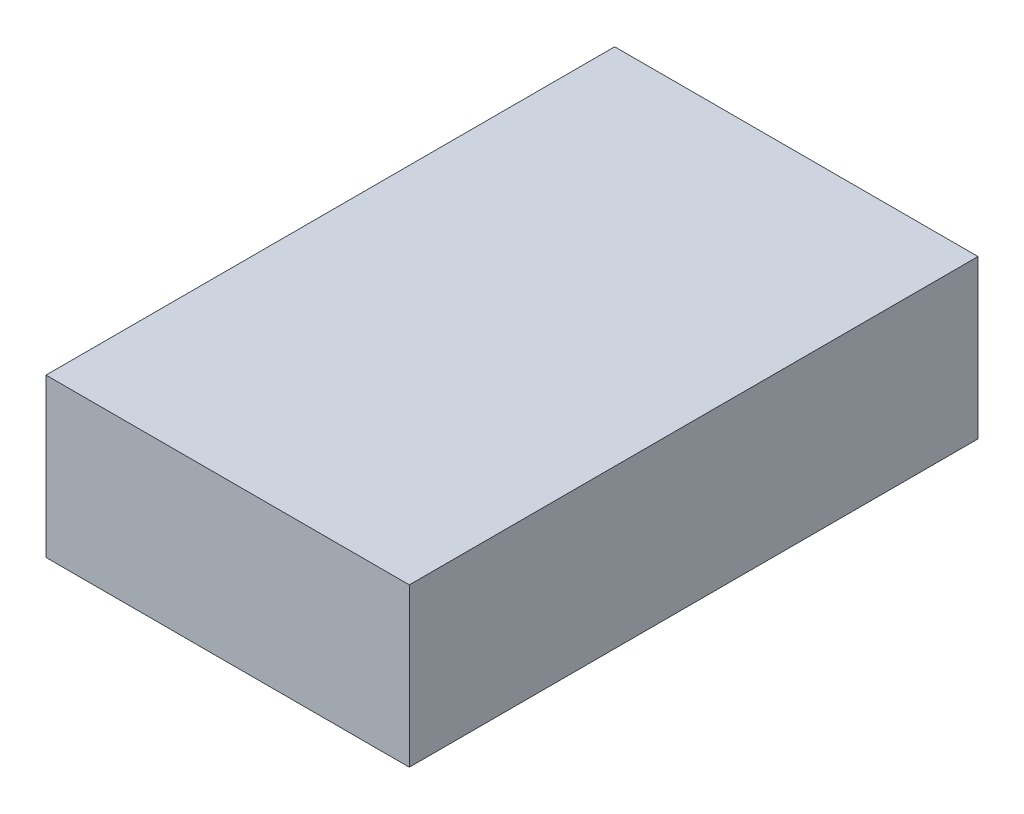
ISO-10303-21;
HEADER;
FILE_DESCRIPTION(('STEP AP214'),'2;1');
FILE_NAME('part.step','',(''),(''),'','','');
FILE_SCHEMA(('AUTOMOTIVE_DESIGN { 1 0 10303 214 1 1 1 1 }'));
ENDSEC;
DATA;
#1=APPLICATION_CONTEXT('core data for automotive mechanical design processes');
#2=APPLICATION_PROTOCOL_DEFINITION('international standard','automotive_design',2000,#1);
#3=PRODUCT_CONTEXT('',#1,'mechanical');
#4=PRODUCT('Part','Part','',(#3));
#5=PRODUCT_RELATED_PRODUCT_CATEGORY('part','',(#4));
#6=PRODUCT_DEFINITION_FORMATION('','',#4);
#7=PRODUCT_DEFINITION_CONTEXT('part definition',#1,'design');
#8=PRODUCT_DEFINITION('design','',#6,#7);
#9=PRODUCT_DEFINITION_SHAPE('','',#8);
#10=(LENGTH_UNIT() NAMED_UNIT(*) SI_UNIT(.MILLI.,.METRE.));
#11=(NAMED_UNIT(*) PLANE_ANGLE_UNIT() SI_UNIT($,.RADIAN.));
#12=(NAMED_UNIT(*) SI_UNIT($,.STERADIAN.) SOLID_ANGLE_UNIT());
#13=UNCERTAINTY_MEASURE_WITH_UNIT(LENGTH_MEASURE(1.E-05),#10,'distance_accuracy_value','');
#14=(GEOMETRIC_REPRESENTATION_CONTEXT(3) GLOBAL_UNCERTAINTY_ASSIGNED_CONTEXT((#13)) GLOBAL_UNIT_ASSIGNED_CONTEXT((#10,
#11,#12)) REPRESENTATION_CONTEXT('',''));
#15=CARTESIAN_POINT('',(0.,0.,0.));
#16=DIRECTION('',(0.,0.,1.));
#17=DIRECTION('',(1.,0.,0.));
#18=AXIS2_PLACEMENT_3D('',#15,#16,#17);
#19=CARTESIAN_POINT('',(-11.2996515679442,10.,-1.88327526132404));
#20=DIRECTION('',(1.,0.,0.));
#21=DIRECTION('',(0.,0.,-1.));
#22=AXIS2_PLACEMENT_3D('',#19,#20,#21);
#23=PLANE('',#22);
#24=DIRECTION('',(0.,0.,1.));
#25=VECTOR('',#24,1.);
#26=CARTESIAN_POINT('',(-11.2996515679442,0.,-1.88327526132404));
#27=LINE('',#26,#25);
#28=CARTESIAN_POINT('',(-11.2996515679442,0.,-1.88327526132404));
#29=VERTEX_POINT('',#28);
#30=CARTESIAN_POINT('',(-11.2996515679442,0.,34.116724738676));
#31=VERTEX_POINT('',#30);
#32=EDGE_CURVE('E96',#29,#31,#27,.T.);
#33=ORIENTED_EDGE('',*,*,#32,.T.);
#34=DIRECTION('',(0.,-1.,0.));
#35=VECTOR('',#34,1.);
#36=CARTESIAN_POINT('',(-11.2996515679442,10.,34.116724738676));
#37=LINE('',#36,#35);
#38=CARTESIAN_POINT('',(-11.2996515679442,10.,34.116724738676));
#39=VERTEX_POINT('',#38);
#40=EDGE_CURVE('E11',#39,#31,#37,.T.);
#41=ORIENTED_EDGE('',*,*,#40,.F.);
#42=DIRECTION('',(0.,0.,1.));
#43=VECTOR('',#42,1.);
#44=CARTESIAN_POINT('',(-11.2996515679442,10.,-1.88327526132404));
#45=LINE('',#44,#43);
#46=CARTESIAN_POINT('',(-11.2996515679442,10.,-1.88327526132404));
#47=VERTEX_POINT('',#46);
#48=EDGE_CURVE('E84',#47,#39,#45,.T.);
#49=ORIENTED_EDGE('',*,*,#48,.F.);
#50=DIRECTION('',(0.,-1.,0.));
#51=VECTOR('',#50,1.);
#52=CARTESIAN_POINT('',(-11.2996515679442,10.,-1.88327526132404));
#53=LINE('',#52,#51);
#54=EDGE_CURVE('E92',#47,#29,#53,.T.);
#55=ORIENTED_EDGE('',*,*,#54,.T.);
#56=EDGE_LOOP('',(#33,#41,#49,#55));
#57=FACE_BOUND('',#56,.T.);
#58=ADVANCED_FACE('F33',(#57),#23,.F.);
#59=CARTESIAN_POINT('',(-11.2996515679442,10.,34.116724738676));
#60=DIRECTION('',(0.,0.,-1.));
#61=DIRECTION('',(-1.,0.,0.));
#62=AXIS2_PLACEMENT_3D('',#59,#60,#61);
#63=PLANE('',#62);
#64=DIRECTION('',(1.,0.,0.));
#65=VECTOR('',#64,1.);
#66=CARTESIAN_POINT('',(-11.2996515679442,0.,34.116724738676));
#67=LINE('',#66,#65);
#68=CARTESIAN_POINT('',(11.7003484320558,0.,34.116724738676));
#69=VERTEX_POINT('',#68);
#70=EDGE_CURVE('E88',#31,#69,#67,.T.);
#71=ORIENTED_EDGE('',*,*,#70,.T.);
#72=DIRECTION('',(0.,-1.,0.));
#73=VECTOR('',#72,1.);
#74=CARTESIAN_POINT('',(11.7003484320558,10.,34.116724738676));
#75=LINE('',#74,#73);
#76=CARTESIAN_POINT('',(11.7003484320558,10.,34.116724738676));
#77=VERTEX_POINT('',#76);
#78=EDGE_CURVE('E41',#77,#69,#75,.T.);
#79=ORIENTED_EDGE('',*,*,#78,.F.);
#80=DIRECTION('',(1.,0.,0.));
#81=VECTOR('',#80,1.);
#82=CARTESIAN_POINT('',(-11.2996515679442,10.,34.116724738676));
#83=LINE('',#82,#81);
#84=EDGE_CURVE('E79',#39,#77,#83,.T.);
#85=ORIENTED_EDGE('',*,*,#84,.F.);
#86=ORIENTED_EDGE('',*,*,#40,.T.);
#87=EDGE_LOOP('',(#71,#79,#85,#86));
#88=FACE_BOUND('',#87,.T.);
#89=ADVANCED_FACE('F87',(#88),#63,.F.);
#90=CARTESIAN_POINT('',(11.7003484320558,10.,-1.88327526132404));
#91=DIRECTION('',(-1.,0.,0.));
#92=DIRECTION('',(0.,0.,1.));
#93=AXIS2_PLACEMENT_3D('',#90,#91,#92);
#94=PLANE('',#93);
#95=DIRECTION('',(0.,0.,-1.));
#96=VECTOR('',#95,1.);
#97=CARTESIAN_POINT('',(11.7003484320558,0.,-1.88327526132404));
#98=LINE('',#97,#96);
#99=CARTESIAN_POINT('',(11.7003484320558,0.,-1.88327526132404));
#100=VERTEX_POINT('',#99);
#101=EDGE_CURVE('E66',#69,#100,#98,.T.);
#102=ORIENTED_EDGE('',*,*,#101,.T.);
#103=DIRECTION('',(0.,-1.,0.));
#104=VECTOR('',#103,1.);
#105=CARTESIAN_POINT('',(11.7003484320558,10.,-1.88327526132404));
#106=LINE('',#105,#104);
#107=CARTESIAN_POINT('',(11.7003484320558,10.,-1.88327526132404));
#108=VERTEX_POINT('',#107);
#109=EDGE_CURVE('E89',#108,#100,#106,.T.);
#110=ORIENTED_EDGE('',*,*,#109,.F.);
#111=DIRECTION('',(0.,0.,-1.));
#112=VECTOR('',#111,1.);
#113=CARTESIAN_POINT('',(11.7003484320558,10.,-1.88327526132404));
#114=LINE('',#113,#112);
#115=EDGE_CURVE('E82',#77,#108,#114,.T.);
#116=ORIENTED_EDGE('',*,*,#115,.F.);
#117=ORIENTED_EDGE('',*,*,#78,.T.);
#118=EDGE_LOOP('',(#102,#110,#116,#117));
#119=FACE_BOUND('',#118,.T.);
#120=ADVANCED_FACE('F90',(#119),#94,.F.);
#121=CARTESIAN_POINT('',(-11.2996515679442,10.,-1.88327526132404));
#122=DIRECTION('',(0.,0.,1.));
#123=DIRECTION('',(1.,0.,0.));
#124=AXIS2_PLACEMENT_3D('',#121,#122,#123);
#125=PLANE('',#124);
#126=DIRECTION('',(-1.,0.,0.));
#127=VECTOR('',#126,1.);
#128=CARTESIAN_POINT('',(-11.2996515679442,0.,-1.88327526132404));
#129=LINE('',#128,#127);
#130=EDGE_CURVE('E72',#100,#29,#129,.T.);
#131=ORIENTED_EDGE('',*,*,#130,.T.);
#132=ORIENTED_EDGE('',*,*,#54,.F.);
#133=DIRECTION('',(-1.,0.,0.));
#134=VECTOR('',#133,1.);
#135=CARTESIAN_POINT('',(-11.2996515679442,10.,-1.88327526132404));
#136=LINE('',#135,#134);
#137=EDGE_CURVE('E49',#108,#47,#136,.T.);
#138=ORIENTED_EDGE('',*,*,#137,.F.);
#139=ORIENTED_EDGE('',*,*,#109,.T.);
#140=EDGE_LOOP('',(#131,#132,#138,#139));
#141=FACE_BOUND('',#140,.T.);
#142=ADVANCED_FACE('F103',(#141),#125,.F.);
#143=CARTESIAN_POINT('',(0.,10.,0.));
#144=DIRECTION('',(0.,1.,0.));
#145=DIRECTION('',(0.,0.,1.));
#146=AXIS2_PLACEMENT_3D('',#143,#144,#145);
#147=PLANE('',#146);
#148=ORIENTED_EDGE('',*,*,#48,.T.);
#149=ORIENTED_EDGE('',*,*,#84,.T.);
#150=ORIENTED_EDGE('',*,*,#115,.T.);
#151=ORIENTED_EDGE('',*,*,#137,.T.);
#152=EDGE_LOOP('',(#148,#149,#150,#151));
#153=FACE_BOUND('',#152,.T.);
#154=ADVANCED_FACE('F80',(#153),#147,.T.);
#155=CARTESIAN_POINT('',(0.,0.,0.));
#156=DIRECTION('',(0.,1.,0.));
#157=DIRECTION('',(0.,0.,1.));
#158=AXIS2_PLACEMENT_3D('',#155,#156,#157);
#159=PLANE('',#158);
#160=ORIENTED_EDGE('',*,*,#32,.F.);
#161=ORIENTED_EDGE('',*,*,#130,.F.);
#162=ORIENTED_EDGE('',*,*,#101,.F.);
#163=ORIENTED_EDGE('',*,*,#70,.F.);
#164=EDGE_LOOP('',(#160,#161,#162,#163));
#165=FACE_BOUND('',#164,.T.);
#166=ADVANCED_FACE('F106',(#165),#159,.F.);
#167=CLOSED_SHELL('',(#58,#89,#120,#142,#154,#166));
#168=MANIFOLD_SOLID_BREP('B2',#167);
#169=ADVANCED_BREP_SHAPE_REPRESENTATION('',(#18,#168),#14);
#170=SHAPE_DEFINITION_REPRESENTATION(#9,#169);
ENDSEC;
END-ISO-10303-21;
